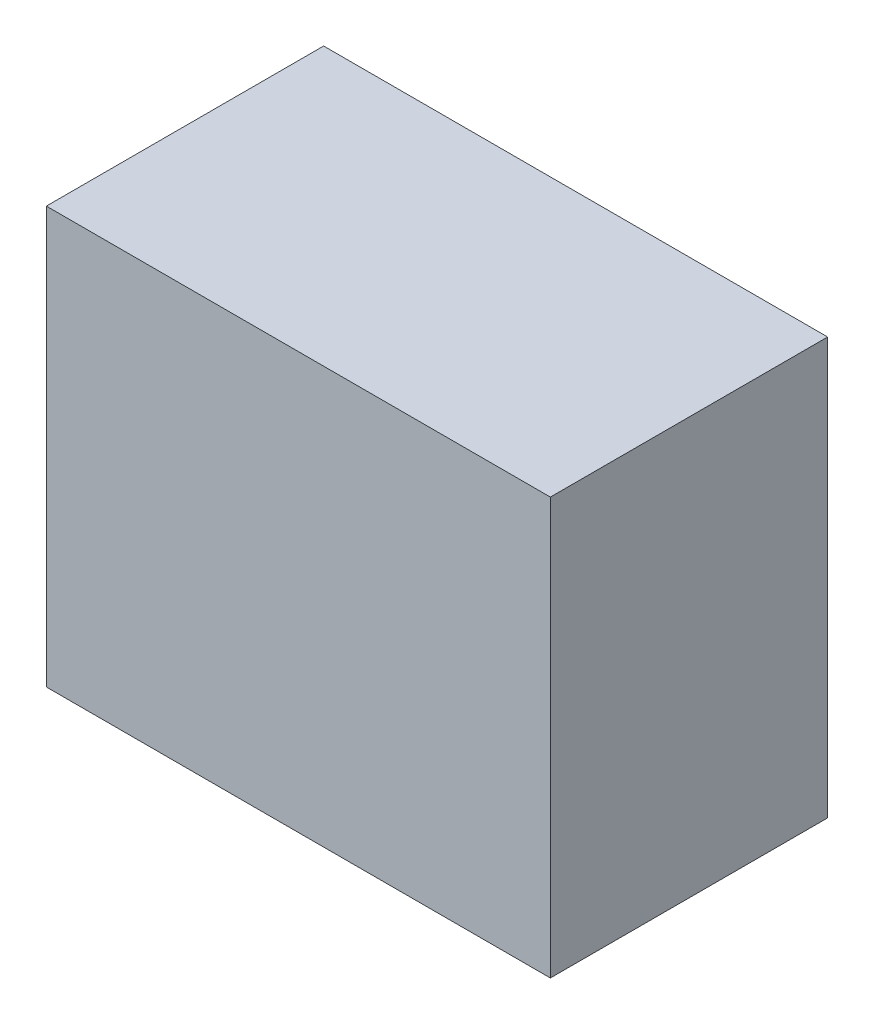
ISO-10303-21;
HEADER;
FILE_DESCRIPTION(('STEP AP214'),'2;1');
FILE_NAME('part.step','',(''),(''),'','','');
FILE_SCHEMA(('AUTOMOTIVE_DESIGN { 1 0 10303 214 1 1 1 1 }'));
ENDSEC;
DATA;
#1=APPLICATION_CONTEXT('core data for automotive mechanical design processes');
#2=APPLICATION_PROTOCOL_DEFINITION('international standard','automotive_design',2000,#1);
#3=PRODUCT_CONTEXT('',#1,'mechanical');
#4=PRODUCT('Part','Part','',(#3));
#5=PRODUCT_RELATED_PRODUCT_CATEGORY('part','',(#4));
#6=PRODUCT_DEFINITION_FORMATION('','',#4);
#7=PRODUCT_DEFINITION_CONTEXT('part definition',#1,'design');
#8=PRODUCT_DEFINITION('design','',#6,#7);
#9=PRODUCT_DEFINITION_SHAPE('','',#8);
#10=(LENGTH_UNIT() NAMED_UNIT(*) SI_UNIT(.MILLI.,.METRE.));
#11=(NAMED_UNIT(*) PLANE_ANGLE_UNIT() SI_UNIT($,.RADIAN.));
#12=(NAMED_UNIT(*) SI_UNIT($,.STERADIAN.) SOLID_ANGLE_UNIT());
#13=UNCERTAINTY_MEASURE_WITH_UNIT(LENGTH_MEASURE(1.E-05),#10,'distance_accuracy_value','');
#14=(GEOMETRIC_REPRESENTATION_CONTEXT(3) GLOBAL_UNCERTAINTY_ASSIGNED_CONTEXT((#13)) GLOBAL_UNIT_ASSIGNED_CONTEXT((#10,
#11,#12)) REPRESENTATION_CONTEXT('',''));
#15=CARTESIAN_POINT('',(0.,0.,0.));
#16=DIRECTION('',(0.,0.,1.));
#17=DIRECTION('',(1.,0.,0.));
#18=AXIS2_PLACEMENT_3D('',#15,#16,#17);
#19=CARTESIAN_POINT('',(164.592,136.017,181.102));
#20=DIRECTION('',(-1.,0.,0.));
#21=DIRECTION('',(0.,0.,1.));
#22=AXIS2_PLACEMENT_3D('',#19,#20,#21);
#23=PLANE('',#22);
#24=DIRECTION('',(0.,1.,0.));
#25=VECTOR('',#24,1.);
#26=CARTESIAN_POINT('',(164.592,136.017,0.));
#27=LINE('',#26,#25);
#28=CARTESIAN_POINT('',(164.592,-136.017,0.));
#29=VERTEX_POINT('',#28);
#30=CARTESIAN_POINT('',(164.592,136.017,0.));
#31=VERTEX_POINT('',#30);
#32=EDGE_CURVE('E99',#29,#31,#27,.T.);
#33=ORIENTED_EDGE('',*,*,#32,.T.);
#34=DIRECTION('',(0.,0.,-1.));
#35=VECTOR('',#34,1.);
#36=CARTESIAN_POINT('',(164.592,136.017,181.102));
#37=LINE('',#36,#35);
#38=CARTESIAN_POINT('',(164.592,136.017,181.102));
#39=VERTEX_POINT('',#38);
#40=EDGE_CURVE('E11',#39,#31,#37,.T.);
#41=ORIENTED_EDGE('',*,*,#40,.F.);
#42=DIRECTION('',(0.,1.,0.));
#43=VECTOR('',#42,1.);
#44=CARTESIAN_POINT('',(164.592,136.017,181.102));
#45=LINE('',#44,#43);
#46=CARTESIAN_POINT('',(164.592,-136.017,181.102));
#47=VERTEX_POINT('',#46);
#48=EDGE_CURVE('E87',#47,#39,#45,.T.);
#49=ORIENTED_EDGE('',*,*,#48,.F.);
#50=DIRECTION('',(0.,0.,-1.));
#51=VECTOR('',#50,1.);
#52=CARTESIAN_POINT('',(164.592,-136.017,181.102));
#53=LINE('',#52,#51);
#54=EDGE_CURVE('E95',#47,#29,#53,.T.);
#55=ORIENTED_EDGE('',*,*,#54,.T.);
#56=EDGE_LOOP('',(#33,#41,#49,#55));
#57=FACE_BOUND('',#56,.T.);
#58=ADVANCED_FACE('F36',(#57),#23,.F.);
#59=CARTESIAN_POINT('',(-164.592,136.017,181.102));
#60=DIRECTION('',(0.,-1.,0.));
#61=DIRECTION('',(0.,0.,-1.));
#62=AXIS2_PLACEMENT_3D('',#59,#60,#61);
#63=PLANE('',#62);
#64=DIRECTION('',(-1.,0.,0.));
#65=VECTOR('',#64,1.);
#66=CARTESIAN_POINT('',(-164.592,136.017,0.));
#67=LINE('',#66,#65);
#68=CARTESIAN_POINT('',(-164.592,136.017,0.));
#69=VERTEX_POINT('',#68);
#70=EDGE_CURVE('E91',#31,#69,#67,.T.);
#71=ORIENTED_EDGE('',*,*,#70,.T.);
#72=DIRECTION('',(0.,0.,-1.));
#73=VECTOR('',#72,1.);
#74=CARTESIAN_POINT('',(-164.592,136.017,181.102));
#75=LINE('',#74,#73);
#76=CARTESIAN_POINT('',(-164.592,136.017,181.102));
#77=VERTEX_POINT('',#76);
#78=EDGE_CURVE('E44',#77,#69,#75,.T.);
#79=ORIENTED_EDGE('',*,*,#78,.F.);
#80=DIRECTION('',(-1.,0.,0.));
#81=VECTOR('',#80,1.);
#82=CARTESIAN_POINT('',(-164.592,136.017,181.102));
#83=LINE('',#82,#81);
#84=EDGE_CURVE('E82',#39,#77,#83,.T.);
#85=ORIENTED_EDGE('',*,*,#84,.F.);
#86=ORIENTED_EDGE('',*,*,#40,.T.);
#87=EDGE_LOOP('',(#71,#79,#85,#86));
#88=FACE_BOUND('',#87,.T.);
#89=ADVANCED_FACE('F90',(#88),#63,.F.);
#90=CARTESIAN_POINT('',(-164.592,136.017,181.102));
#91=DIRECTION('',(1.,0.,0.));
#92=DIRECTION('',(0.,0.,-1.));
#93=AXIS2_PLACEMENT_3D('',#90,#91,#92);
#94=PLANE('',#93);
#95=DIRECTION('',(0.,-1.,0.));
#96=VECTOR('',#95,1.);
#97=CARTESIAN_POINT('',(-164.592,136.017,0.));
#98=LINE('',#97,#96);
#99=CARTESIAN_POINT('',(-164.592,-136.017,0.));
#100=VERTEX_POINT('',#99);
#101=EDGE_CURVE('E69',#69,#100,#98,.T.);
#102=ORIENTED_EDGE('',*,*,#101,.T.);
#103=DIRECTION('',(0.,0.,-1.));
#104=VECTOR('',#103,1.);
#105=CARTESIAN_POINT('',(-164.592,-136.017,181.102));
#106=LINE('',#105,#104);
#107=CARTESIAN_POINT('',(-164.592,-136.017,181.102));
#108=VERTEX_POINT('',#107);
#109=EDGE_CURVE('E92',#108,#100,#106,.T.);
#110=ORIENTED_EDGE('',*,*,#109,.F.);
#111=DIRECTION('',(0.,-1.,0.));
#112=VECTOR('',#111,1.);
#113=CARTESIAN_POINT('',(-164.592,136.017,181.102));
#114=LINE('',#113,#112);
#115=EDGE_CURVE('E85',#77,#108,#114,.T.);
#116=ORIENTED_EDGE('',*,*,#115,.F.);
#117=ORIENTED_EDGE('',*,*,#78,.T.);
#118=EDGE_LOOP('',(#102,#110,#116,#117));
#119=FACE_BOUND('',#118,.T.);
#120=ADVANCED_FACE('F93',(#119),#94,.F.);
#121=CARTESIAN_POINT('',(-164.592,-136.017,181.102));
#122=DIRECTION('',(0.,1.,0.));
#123=DIRECTION('',(0.,0.,1.));
#124=AXIS2_PLACEMENT_3D('',#121,#122,#123);
#125=PLANE('',#124);
#126=DIRECTION('',(1.,0.,0.));
#127=VECTOR('',#126,1.);
#128=CARTESIAN_POINT('',(-164.592,-136.017,0.));
#129=LINE('',#128,#127);
#130=EDGE_CURVE('E75',#100,#29,#129,.T.);
#131=ORIENTED_EDGE('',*,*,#130,.T.);
#132=ORIENTED_EDGE('',*,*,#54,.F.);
#133=DIRECTION('',(1.,0.,0.));
#134=VECTOR('',#133,1.);
#135=CARTESIAN_POINT('',(-164.592,-136.017,181.102));
#136=LINE('',#135,#134);
#137=EDGE_CURVE('E52',#108,#47,#136,.T.);
#138=ORIENTED_EDGE('',*,*,#137,.F.);
#139=ORIENTED_EDGE('',*,*,#109,.T.);
#140=EDGE_LOOP('',(#131,#132,#138,#139));
#141=FACE_BOUND('',#140,.T.);
#142=ADVANCED_FACE('F106',(#141),#125,.F.);
#143=CARTESIAN_POINT('',(0.,0.,181.102));
#144=DIRECTION('',(0.,0.,1.));
#145=DIRECTION('',(1.,0.,0.));
#146=AXIS2_PLACEMENT_3D('',#143,#144,#145);
#147=PLANE('',#146);
#148=ORIENTED_EDGE('',*,*,#48,.T.);
#149=ORIENTED_EDGE('',*,*,#84,.T.);
#150=ORIENTED_EDGE('',*,*,#115,.T.);
#151=ORIENTED_EDGE('',*,*,#137,.T.);
#152=EDGE_LOOP('',(#148,#149,#150,#151));
#153=FACE_BOUND('',#152,.T.);
#154=ADVANCED_FACE('F83',(#153),#147,.T.);
#155=CARTESIAN_POINT('',(0.,0.,0.));
#156=DIRECTION('',(0.,0.,1.));
#157=DIRECTION('',(1.,0.,0.));
#158=AXIS2_PLACEMENT_3D('',#155,#156,#157);
#159=PLANE('',#158);
#160=ORIENTED_EDGE('',*,*,#32,.F.);
#161=ORIENTED_EDGE('',*,*,#130,.F.);
#162=ORIENTED_EDGE('',*,*,#101,.F.);
#163=ORIENTED_EDGE('',*,*,#70,.F.);
#164=EDGE_LOOP('',(#160,#161,#162,#163));
#165=FACE_BOUND('',#164,.T.);
#166=ADVANCED_FACE('F109',(#165),#159,.F.);
#167=CLOSED_SHELL('',(#58,#89,#120,#142,#154,#166));
#168=MANIFOLD_SOLID_BREP('B2',#167);
#169=ADVANCED_BREP_SHAPE_REPRESENTATION('',(#18,#168),#14);
#170=SHAPE_DEFINITION_REPRESENTATION(#9,#169);
ENDSEC;
END-ISO-10303-21;
